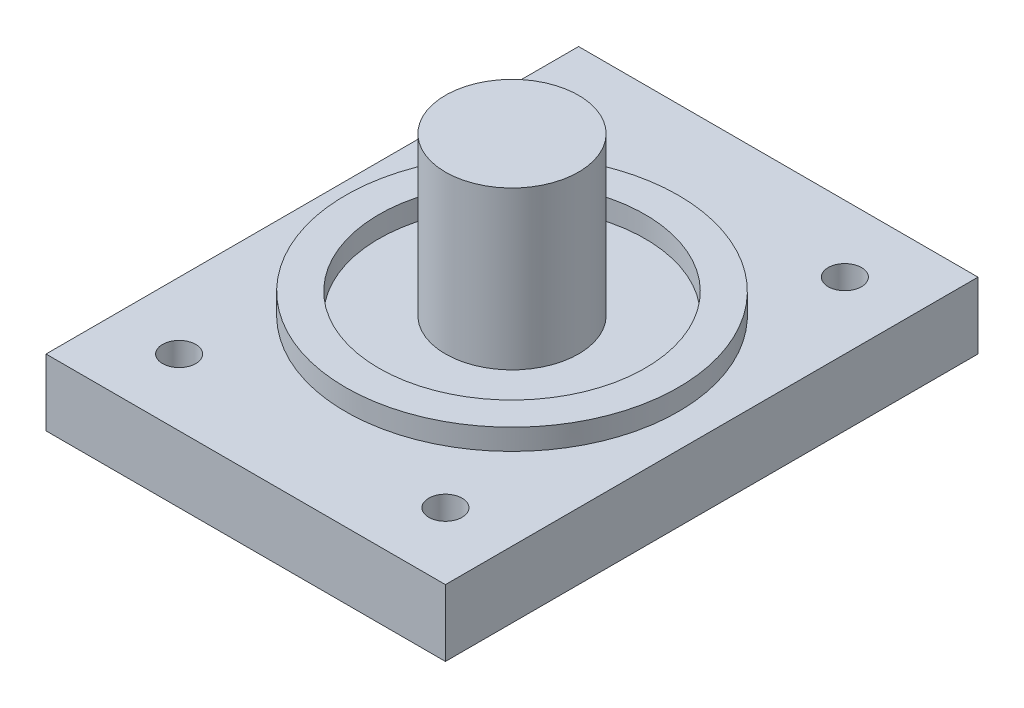
ISO-10303-21;
HEADER;
FILE_DESCRIPTION(('STEP AP214'),'2;1');
FILE_NAME('part.step','',(''),(''),'','','');
FILE_SCHEMA(('AUTOMOTIVE_DESIGN { 1 0 10303 214 1 1 1 1 }'));
ENDSEC;
DATA;
#1=APPLICATION_CONTEXT('core data for automotive mechanical design processes');
#2=APPLICATION_PROTOCOL_DEFINITION('international standard','automotive_design',2000,#1);
#3=PRODUCT_CONTEXT('',#1,'mechanical');
#4=PRODUCT('Part','Part','',(#3));
#5=PRODUCT_RELATED_PRODUCT_CATEGORY('part','',(#4));
#6=PRODUCT_DEFINITION_FORMATION('','',#4);
#7=PRODUCT_DEFINITION_CONTEXT('part definition',#1,'design');
#8=PRODUCT_DEFINITION('design','',#6,#7);
#9=PRODUCT_DEFINITION_SHAPE('','',#8);
#10=(LENGTH_UNIT() NAMED_UNIT(*) SI_UNIT(.MILLI.,.METRE.));
#11=(NAMED_UNIT(*) PLANE_ANGLE_UNIT() SI_UNIT($,.RADIAN.));
#12=(NAMED_UNIT(*) SI_UNIT($,.STERADIAN.) SOLID_ANGLE_UNIT());
#13=UNCERTAINTY_MEASURE_WITH_UNIT(LENGTH_MEASURE(1.E-05),#10,'distance_accuracy_value','');
#14=(GEOMETRIC_REPRESENTATION_CONTEXT(3) GLOBAL_UNCERTAINTY_ASSIGNED_CONTEXT((#13)) GLOBAL_UNIT_ASSIGNED_CONTEXT((#10,
#11,#12)) REPRESENTATION_CONTEXT('',''));
#15=CARTESIAN_POINT('',(0.,0.,0.));
#16=DIRECTION('',(0.,0.,1.));
#17=DIRECTION('',(1.,0.,0.));
#18=AXIS2_PLACEMENT_3D('',#15,#16,#17);
#19=CARTESIAN_POINT('',(0.,3.175,0.));
#20=DIRECTION('',(1.,0.,0.));
#21=DIRECTION('',(0.,0.,-1.));
#22=AXIS2_PLACEMENT_3D('',#19,#20,#21);
#23=PLANE('',#22);
#24=DIRECTION('',(0.,0.,1.));
#25=VECTOR('',#24,1.);
#26=CARTESIAN_POINT('',(0.,0.,0.));
#27=LINE('',#26,#25);
#28=CARTESIAN_POINT('',(0.,0.,-25.4));
#29=VERTEX_POINT('',#28);
#30=CARTESIAN_POINT('',(0.,0.,0.));
#31=VERTEX_POINT('',#30);
#32=EDGE_CURVE('E99',#29,#31,#27,.T.);
#33=ORIENTED_EDGE('',*,*,#32,.T.);
#34=DIRECTION('',(0.,-1.,0.));
#35=VECTOR('',#34,1.);
#36=CARTESIAN_POINT('',(0.,3.175,0.));
#37=LINE('',#36,#35);
#38=CARTESIAN_POINT('',(0.,3.175,0.));
#39=VERTEX_POINT('',#38);
#40=EDGE_CURVE('E90',#39,#31,#37,.T.);
#41=ORIENTED_EDGE('',*,*,#40,.F.);
#42=DIRECTION('',(0.,0.,1.));
#43=VECTOR('',#42,1.);
#44=CARTESIAN_POINT('',(0.,3.175,0.));
#45=LINE('',#44,#43);
#46=CARTESIAN_POINT('',(0.,3.175,-25.4));
#47=VERTEX_POINT('',#46);
#48=EDGE_CURVE('E84',#47,#39,#45,.T.);
#49=ORIENTED_EDGE('',*,*,#48,.F.);
#50=DIRECTION('',(0.,-1.,0.));
#51=VECTOR('',#50,1.);
#52=CARTESIAN_POINT('',(0.,3.175,-25.4));
#53=LINE('',#52,#51);
#54=EDGE_CURVE('E95',#47,#29,#53,.T.);
#55=ORIENTED_EDGE('',*,*,#54,.T.);
#56=EDGE_LOOP('',(#33,#41,#49,#55));
#57=FACE_BOUND('',#56,.T.);
#58=ADVANCED_FACE('F32',(#57),#23,.F.);
#59=CARTESIAN_POINT('',(0.,3.175,0.));
#60=DIRECTION('',(0.,0.,-1.));
#61=DIRECTION('',(-1.,0.,0.));
#62=AXIS2_PLACEMENT_3D('',#59,#60,#61);
#63=PLANE('',#62);
#64=DIRECTION('',(1.,0.,0.));
#65=VECTOR('',#64,1.);
#66=CARTESIAN_POINT('',(0.,0.,0.));
#67=LINE('',#66,#65);
#68=CARTESIAN_POINT('',(19.05,0.,0.));
#69=VERTEX_POINT('',#68);
#70=EDGE_CURVE('E89',#31,#69,#67,.T.);
#71=ORIENTED_EDGE('',*,*,#70,.T.);
#72=DIRECTION('',(0.,-1.,0.));
#73=VECTOR('',#72,1.);
#74=CARTESIAN_POINT('',(19.05,3.175,0.));
#75=LINE('',#74,#73);
#76=CARTESIAN_POINT('',(19.05,3.175,0.));
#77=VERTEX_POINT('',#76);
#78=EDGE_CURVE('E87',#77,#69,#75,.T.);
#79=ORIENTED_EDGE('',*,*,#78,.F.);
#80=DIRECTION('',(1.,0.,0.));
#81=VECTOR('',#80,1.);
#82=CARTESIAN_POINT('',(0.,3.175,0.));
#83=LINE('',#82,#81);
#84=EDGE_CURVE('E79',#39,#77,#83,.T.);
#85=ORIENTED_EDGE('',*,*,#84,.F.);
#86=ORIENTED_EDGE('',*,*,#40,.T.);
#87=EDGE_LOOP('',(#71,#79,#85,#86));
#88=FACE_BOUND('',#87,.T.);
#89=ADVANCED_FACE('F88',(#88),#63,.F.);
#90=CARTESIAN_POINT('',(19.05,3.175,0.));
#91=DIRECTION('',(-1.,0.,0.));
#92=DIRECTION('',(0.,0.,1.));
#93=AXIS2_PLACEMENT_3D('',#90,#91,#92);
#94=PLANE('',#93);
#95=DIRECTION('',(0.,0.,-1.));
#96=VECTOR('',#95,1.);
#97=CARTESIAN_POINT('',(19.05,0.,0.));
#98=LINE('',#97,#96);
#99=CARTESIAN_POINT('',(19.05,0.,-25.4));
#100=VERTEX_POINT('',#99);
#101=EDGE_CURVE('E65',#69,#100,#98,.T.);
#102=ORIENTED_EDGE('',*,*,#101,.T.);
#103=DIRECTION('',(0.,-1.,0.));
#104=VECTOR('',#103,1.);
#105=CARTESIAN_POINT('',(19.05,3.175,-25.4));
#106=LINE('',#105,#104);
#107=CARTESIAN_POINT('',(19.05,3.175,-25.4));
#108=VERTEX_POINT('',#107);
#109=EDGE_CURVE('E91',#108,#100,#106,.T.);
#110=ORIENTED_EDGE('',*,*,#109,.F.);
#111=DIRECTION('',(0.,0.,-1.));
#112=VECTOR('',#111,1.);
#113=CARTESIAN_POINT('',(19.05,3.175,0.));
#114=LINE('',#113,#112);
#115=EDGE_CURVE('E82',#77,#108,#114,.T.);
#116=ORIENTED_EDGE('',*,*,#115,.F.);
#117=ORIENTED_EDGE('',*,*,#78,.T.);
#118=EDGE_LOOP('',(#102,#110,#116,#117));
#119=FACE_BOUND('',#118,.T.);
#120=ADVANCED_FACE('F93',(#119),#94,.F.);
#121=CARTESIAN_POINT('',(0.,3.175,-25.4));
#122=DIRECTION('',(0.,0.,1.));
#123=DIRECTION('',(1.,0.,0.));
#124=AXIS2_PLACEMENT_3D('',#121,#122,#123);
#125=PLANE('',#124);
#126=DIRECTION('',(-1.,0.,0.));
#127=VECTOR('',#126,1.);
#128=CARTESIAN_POINT('',(0.,0.,-25.4));
#129=LINE('',#128,#127);
#130=EDGE_CURVE('E71',#100,#29,#129,.T.);
#131=ORIENTED_EDGE('',*,*,#130,.T.);
#132=ORIENTED_EDGE('',*,*,#54,.F.);
#133=DIRECTION('',(-1.,0.,0.));
#134=VECTOR('',#133,1.);
#135=CARTESIAN_POINT('',(0.,3.175,-25.4));
#136=LINE('',#135,#134);
#137=EDGE_CURVE('E48',#108,#47,#136,.T.);
#138=ORIENTED_EDGE('',*,*,#137,.F.);
#139=ORIENTED_EDGE('',*,*,#109,.T.);
#140=EDGE_LOOP('',(#131,#132,#138,#139));
#141=FACE_BOUND('',#140,.T.);
#142=ADVANCED_FACE('F186',(#141),#125,.F.);
#143=CARTESIAN_POINT('',(0.,3.175,0.));
#144=DIRECTION('',(0.,-1.,0.));
#145=DIRECTION('',(0.,0.,-1.));
#146=AXIS2_PLACEMENT_3D('',#143,#144,#145);
#147=PLANE('',#146);
#148=CARTESIAN_POINT('',(9.525,3.175,-12.7));
#149=DIRECTION('',(0.,-1.,0.));
#150=DIRECTION('',(0.,0.,-1.));
#151=AXIS2_PLACEMENT_3D('',#148,#149,#150);
#152=CIRCLE('',#151,7.9375);
#153=CARTESIAN_POINT('',(9.525,3.175,-20.6375));
#154=VERTEX_POINT('',#153);
#155=EDGE_CURVE('E11',#154,#154,#152,.F.);
#156=ORIENTED_EDGE('',*,*,#155,.F.);
#157=EDGE_LOOP('',(#156));
#158=FACE_BOUND('',#157,.T.);
#159=CARTESIAN_POINT('',(3.175,3.175,-3.175));
#160=DIRECTION('',(0.,1.,0.));
#161=DIRECTION('',(0.,0.,1.));
#162=AXIS2_PLACEMENT_3D('',#159,#160,#161);
#163=CIRCLE('',#162,0.79375);
#164=CARTESIAN_POINT('',(3.175,3.175,-2.38125));
#165=VERTEX_POINT('',#164);
#166=EDGE_CURVE('E125',#165,#165,#163,.T.);
#167=ORIENTED_EDGE('',*,*,#166,.F.);
#168=EDGE_LOOP('',(#167));
#169=FACE_BOUND('',#168,.T.);
#170=CARTESIAN_POINT('',(15.875,3.175,-3.175));
#171=DIRECTION('',(0.,1.,0.));
#172=DIRECTION('',(0.,0.,1.));
#173=AXIS2_PLACEMENT_3D('',#170,#171,#172);
#174=CIRCLE('',#173,0.793749999999999);
#175=CARTESIAN_POINT('',(15.875,3.175,-2.38125));
#176=VERTEX_POINT('',#175);
#177=EDGE_CURVE('E124',#176,#176,#174,.T.);
#178=ORIENTED_EDGE('',*,*,#177,.F.);
#179=EDGE_LOOP('',(#178));
#180=FACE_BOUND('',#179,.T.);
#181=CARTESIAN_POINT('',(15.875,3.175,-22.225));
#182=DIRECTION('',(0.,1.,0.));
#183=DIRECTION('',(0.,0.,1.));
#184=AXIS2_PLACEMENT_3D('',#181,#182,#183);
#185=CIRCLE('',#184,0.793749999999999);
#186=CARTESIAN_POINT('',(15.875,3.175,-21.43125));
#187=VERTEX_POINT('',#186);
#188=EDGE_CURVE('E132',#187,#187,#185,.T.);
#189=ORIENTED_EDGE('',*,*,#188,.F.);
#190=EDGE_LOOP('',(#189));
#191=FACE_BOUND('',#190,.T.);
#192=CARTESIAN_POINT('',(3.175,3.175,-22.225));
#193=DIRECTION('',(0.,1.,0.));
#194=DIRECTION('',(0.,0.,1.));
#195=AXIS2_PLACEMENT_3D('',#192,#193,#194);
#196=CIRCLE('',#195,0.79375);
#197=CARTESIAN_POINT('',(3.175,3.175,-21.43125));
#198=VERTEX_POINT('',#197);
#199=EDGE_CURVE('E117',#198,#198,#196,.T.);
#200=ORIENTED_EDGE('',*,*,#199,.F.);
#201=EDGE_LOOP('',(#200));
#202=FACE_BOUND('',#201,.T.);
#203=ORIENTED_EDGE('',*,*,#48,.T.);
#204=ORIENTED_EDGE('',*,*,#84,.T.);
#205=ORIENTED_EDGE('',*,*,#115,.T.);
#206=ORIENTED_EDGE('',*,*,#137,.T.);
#207=EDGE_LOOP('',(#203,#204,#205,#206));
#208=FACE_BOUND('',#207,.T.);
#209=ADVANCED_FACE('F80',(#158,#169,#180,#191,#202,#208),#147,.F.);
#210=CARTESIAN_POINT('',(0.,0.,0.));
#211=DIRECTION('',(0.,-1.,0.));
#212=DIRECTION('',(0.,0.,-1.));
#213=AXIS2_PLACEMENT_3D('',#210,#211,#212);
#214=PLANE('',#213);
#215=CARTESIAN_POINT('',(3.175,0.,-3.175));
#216=DIRECTION('',(0.,-1.,0.));
#217=DIRECTION('',(0.,0.,-1.));
#218=AXIS2_PLACEMENT_3D('',#215,#216,#217);
#219=CIRCLE('',#218,0.79375);
#220=CARTESIAN_POINT('',(3.175,0.,-3.96875));
#221=VERTEX_POINT('',#220);
#222=EDGE_CURVE('E121',#221,#221,#219,.F.);
#223=ORIENTED_EDGE('',*,*,#222,.T.);
#224=EDGE_LOOP('',(#223));
#225=FACE_BOUND('',#224,.T.);
#226=CARTESIAN_POINT('',(15.875,0.,-3.175));
#227=DIRECTION('',(0.,-1.,0.));
#228=DIRECTION('',(0.,0.,-1.));
#229=AXIS2_PLACEMENT_3D('',#226,#227,#228);
#230=CIRCLE('',#229,0.793749999999999);
#231=CARTESIAN_POINT('',(15.875,0.,-3.96875));
#232=VERTEX_POINT('',#231);
#233=EDGE_CURVE('E129',#232,#232,#230,.F.);
#234=ORIENTED_EDGE('',*,*,#233,.T.);
#235=EDGE_LOOP('',(#234));
#236=FACE_BOUND('',#235,.T.);
#237=CARTESIAN_POINT('',(15.875,0.,-22.225));
#238=DIRECTION('',(0.,-1.,0.));
#239=DIRECTION('',(0.,0.,-1.));
#240=AXIS2_PLACEMENT_3D('',#237,#238,#239);
#241=CIRCLE('',#240,0.793749999999999);
#242=CARTESIAN_POINT('',(15.875,0.,-23.01875));
#243=VERTEX_POINT('',#242);
#244=EDGE_CURVE('E120',#243,#243,#241,.F.);
#245=ORIENTED_EDGE('',*,*,#244,.T.);
#246=EDGE_LOOP('',(#245));
#247=FACE_BOUND('',#246,.T.);
#248=CARTESIAN_POINT('',(3.175,0.,-22.225));
#249=DIRECTION('',(0.,-1.,0.));
#250=DIRECTION('',(0.,0.,-1.));
#251=AXIS2_PLACEMENT_3D('',#248,#249,#250);
#252=CIRCLE('',#251,0.79375);
#253=CARTESIAN_POINT('',(3.175,0.,-23.01875));
#254=VERTEX_POINT('',#253);
#255=EDGE_CURVE('E114',#254,#254,#252,.F.);
#256=ORIENTED_EDGE('',*,*,#255,.T.);
#257=EDGE_LOOP('',(#256));
#258=FACE_BOUND('',#257,.T.);
#259=ORIENTED_EDGE('',*,*,#32,.F.);
#260=ORIENTED_EDGE('',*,*,#130,.F.);
#261=ORIENTED_EDGE('',*,*,#101,.F.);
#262=ORIENTED_EDGE('',*,*,#70,.F.);
#263=EDGE_LOOP('',(#259,#260,#261,#262));
#264=FACE_BOUND('',#263,.T.);
#265=ADVANCED_FACE('F174',(#225,#236,#247,#258,#264),#214,.T.);
#266=CARTESIAN_POINT('',(3.175,-2.24506403026729,-22.225));
#267=DIRECTION('',(0.,1.,0.));
#268=DIRECTION('',(0.,0.,1.));
#269=AXIS2_PLACEMENT_3D('',#266,#267,#268);
#270=CYLINDRICAL_SURFACE('',#269,0.79375);
#271=ORIENTED_EDGE('',*,*,#199,.T.);
#272=EDGE_LOOP('',(#271));
#273=FACE_BOUND('',#272,.T.);
#274=ORIENTED_EDGE('',*,*,#255,.F.);
#275=EDGE_LOOP('',(#274));
#276=FACE_BOUND('',#275,.T.);
#277=ADVANCED_FACE('F176',(#273,#276),#270,.F.);
#278=CARTESIAN_POINT('',(15.875,-2.24506403026729,-22.225));
#279=DIRECTION('',(0.,1.,0.));
#280=DIRECTION('',(0.,0.,1.));
#281=AXIS2_PLACEMENT_3D('',#278,#279,#280);
#282=CYLINDRICAL_SURFACE('',#281,0.793749999999999);
#283=ORIENTED_EDGE('',*,*,#188,.T.);
#284=EDGE_LOOP('',(#283));
#285=FACE_BOUND('',#284,.T.);
#286=ORIENTED_EDGE('',*,*,#244,.F.);
#287=EDGE_LOOP('',(#286));
#288=FACE_BOUND('',#287,.T.);
#289=ADVANCED_FACE('F183',(#285,#288),#282,.F.);
#290=CARTESIAN_POINT('',(15.875,-2.24506403026729,-3.175));
#291=DIRECTION('',(0.,1.,0.));
#292=DIRECTION('',(0.,0.,1.));
#293=AXIS2_PLACEMENT_3D('',#290,#291,#292);
#294=CYLINDRICAL_SURFACE('',#293,0.793749999999999);
#295=ORIENTED_EDGE('',*,*,#177,.T.);
#296=EDGE_LOOP('',(#295));
#297=FACE_BOUND('',#296,.T.);
#298=ORIENTED_EDGE('',*,*,#233,.F.);
#299=EDGE_LOOP('',(#298));
#300=FACE_BOUND('',#299,.T.);
#301=ADVANCED_FACE('F163',(#297,#300),#294,.F.);
#302=CARTESIAN_POINT('',(3.175,-2.24506403026729,-3.175));
#303=DIRECTION('',(0.,1.,0.));
#304=DIRECTION('',(0.,0.,1.));
#305=AXIS2_PLACEMENT_3D('',#302,#303,#304);
#306=CYLINDRICAL_SURFACE('',#305,0.79375);
#307=ORIENTED_EDGE('',*,*,#166,.T.);
#308=EDGE_LOOP('',(#307));
#309=FACE_BOUND('',#308,.T.);
#310=ORIENTED_EDGE('',*,*,#222,.F.);
#311=EDGE_LOOP('',(#310));
#312=FACE_BOUND('',#311,.T.);
#313=ADVANCED_FACE('F154',(#309,#312),#306,.F.);
#314=CARTESIAN_POINT('',(9.525,4.175,-12.7));
#315=DIRECTION('',(0.,1.,0.));
#316=DIRECTION('',(0.,0.,1.));
#317=AXIS2_PLACEMENT_3D('',#314,#315,#316);
#318=PLANE('',#317);
#319=CARTESIAN_POINT('',(9.525,4.175,-12.7));
#320=DIRECTION('',(0.,1.,0.));
#321=DIRECTION('',(0.,0.,1.));
#322=AXIS2_PLACEMENT_3D('',#319,#320,#321);
#323=CIRCLE('',#322,7.9375);
#324=CARTESIAN_POINT('',(9.525,4.175,-4.7625));
#325=VERTEX_POINT('',#324);
#326=EDGE_CURVE('E128',#325,#325,#323,.T.);
#327=ORIENTED_EDGE('',*,*,#326,.T.);
#328=EDGE_LOOP('',(#327));
#329=FACE_BOUND('',#328,.T.);
#330=CARTESIAN_POINT('',(9.525,4.175,-12.7));
#331=DIRECTION('',(0.,1.,0.));
#332=DIRECTION('',(0.,0.,1.));
#333=AXIS2_PLACEMENT_3D('',#330,#331,#332);
#334=CIRCLE('',#333,6.35);
#335=CARTESIAN_POINT('',(9.525,4.175,-6.35));
#336=VERTEX_POINT('',#335);
#337=EDGE_CURVE('E141',#336,#336,#334,.T.);
#338=ORIENTED_EDGE('',*,*,#337,.F.);
#339=EDGE_LOOP('',(#338));
#340=FACE_BOUND('',#339,.T.);
#341=ADVANCED_FACE('F151',(#329,#340),#318,.T.);
#342=CARTESIAN_POINT('',(9.525,4.175,-12.7));
#343=DIRECTION('',(0.,-1.,0.));
#344=DIRECTION('',(0.,0.,-1.));
#345=AXIS2_PLACEMENT_3D('',#342,#343,#344);
#346=CYLINDRICAL_SURFACE('',#345,7.9375);
#347=ORIENTED_EDGE('',*,*,#326,.F.);
#348=EDGE_LOOP('',(#347));
#349=FACE_BOUND('',#348,.T.);
#350=ORIENTED_EDGE('',*,*,#155,.T.);
#351=EDGE_LOOP('',(#350));
#352=FACE_BOUND('',#351,.T.);
#353=ADVANCED_FACE('F153',(#349,#352),#346,.T.);
#354=CARTESIAN_POINT('',(9.525,4.175,-12.7));
#355=DIRECTION('',(0.,-1.,0.));
#356=DIRECTION('',(0.,0.,-1.));
#357=AXIS2_PLACEMENT_3D('',#354,#355,#356);
#358=CYLINDRICAL_SURFACE('',#357,6.35);
#359=ORIENTED_EDGE('',*,*,#337,.T.);
#360=EDGE_LOOP('',(#359));
#361=FACE_BOUND('',#360,.T.);
#362=CARTESIAN_POINT('',(9.525,3.175,-12.7));
#363=DIRECTION('',(0.,1.,0.));
#364=DIRECTION('',(0.,0.,1.));
#365=AXIS2_PLACEMENT_3D('',#362,#363,#364);
#366=CIRCLE('',#365,6.35);
#367=CARTESIAN_POINT('',(9.525,3.175,-6.35));
#368=VERTEX_POINT('',#367);
#369=EDGE_CURVE('E142',#368,#368,#366,.T.);
#370=ORIENTED_EDGE('',*,*,#369,.F.);
#371=EDGE_LOOP('',(#370));
#372=FACE_BOUND('',#371,.T.);
#373=ADVANCED_FACE('F148',(#361,#372),#358,.F.);
#374=CARTESIAN_POINT('',(9.525,10.6875,-12.7));
#375=DIRECTION('',(0.,1.,0.));
#376=DIRECTION('',(0.,0.,1.));
#377=AXIS2_PLACEMENT_3D('',#374,#375,#376);
#378=PLANE('',#377);
#379=CARTESIAN_POINT('',(9.525,10.6875,-12.7));
#380=DIRECTION('',(0.,1.,0.));
#381=DIRECTION('',(0.,0.,1.));
#382=AXIS2_PLACEMENT_3D('',#379,#380,#381);
#383=CIRCLE('',#382,3.175);
#384=CARTESIAN_POINT('',(9.525,10.6875,-9.525));
#385=VERTEX_POINT('',#384);
#386=EDGE_CURVE('E102',#385,#385,#383,.T.);
#387=ORIENTED_EDGE('',*,*,#386,.T.);
#388=EDGE_LOOP('',(#387));
#389=FACE_BOUND('',#388,.T.);
#390=ADVANCED_FACE('F234',(#389),#378,.T.);
#391=CARTESIAN_POINT('',(9.525,10.6875,-12.7));
#392=DIRECTION('',(0.,-1.,0.));
#393=DIRECTION('',(0.,0.,-1.));
#394=AXIS2_PLACEMENT_3D('',#391,#392,#393);
#395=CYLINDRICAL_SURFACE('',#394,3.175);
#396=ORIENTED_EDGE('',*,*,#386,.F.);
#397=EDGE_LOOP('',(#396));
#398=FACE_BOUND('',#397,.T.);
#399=CARTESIAN_POINT('',(9.525,3.175,-12.7));
#400=DIRECTION('',(0.,1.,0.));
#401=DIRECTION('',(0.,0.,1.));
#402=AXIS2_PLACEMENT_3D('',#399,#400,#401);
#403=CIRCLE('',#402,3.175);
#404=CARTESIAN_POINT('',(9.525,3.175,-9.525));
#405=VERTEX_POINT('',#404);
#406=EDGE_CURVE('E40',#405,#405,#403,.T.);
#407=ORIENTED_EDGE('',*,*,#406,.T.);
#408=EDGE_LOOP('',(#407));
#409=FACE_BOUND('',#408,.T.);
#410=ADVANCED_FACE('F241',(#398,#409),#395,.T.);
#411=ORIENTED_EDGE('',*,*,#406,.F.);
#412=EDGE_LOOP('',(#411));
#413=FACE_BOUND('',#412,.T.);
#414=ORIENTED_EDGE('',*,*,#369,.T.);
#415=EDGE_LOOP('',(#414));
#416=FACE_BOUND('',#415,.T.);
#417=ADVANCED_FACE('F189',(#413,#416),#147,.F.);
#418=CLOSED_SHELL('',(#58,#89,#120,#142,#209,#265,#277,#289,#301,#313,#341,#353,#373,#390,#410,#417));
#419=MANIFOLD_SOLID_BREP('B2',#418);
#420=ADVANCED_BREP_SHAPE_REPRESENTATION('',(#18,#419),#14);
#421=SHAPE_DEFINITION_REPRESENTATION(#9,#420);
ENDSEC;
END-ISO-10303-21;
